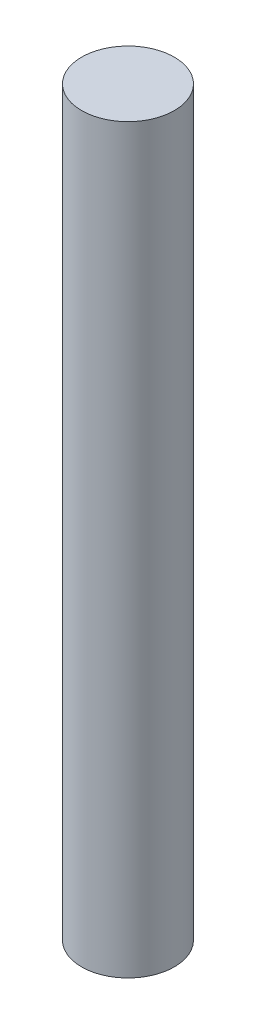
ISO-10303-21;
HEADER;
FILE_DESCRIPTION(('STEP AP214'),'2;1');
FILE_NAME('part.step','',(''),(''),'','','');
FILE_SCHEMA(('AUTOMOTIVE_DESIGN { 1 0 10303 214 1 1 1 1 }'));
ENDSEC;
DATA;
#1=APPLICATION_CONTEXT('core data for automotive mechanical design processes');
#2=APPLICATION_PROTOCOL_DEFINITION('international standard','automotive_design',2000,#1);
#3=PRODUCT_CONTEXT('',#1,'mechanical');
#4=PRODUCT('Part','Part','',(#3));
#5=PRODUCT_RELATED_PRODUCT_CATEGORY('part','',(#4));
#6=PRODUCT_DEFINITION_FORMATION('','',#4);
#7=PRODUCT_DEFINITION_CONTEXT('part definition',#1,'design');
#8=PRODUCT_DEFINITION('design','',#6,#7);
#9=PRODUCT_DEFINITION_SHAPE('','',#8);
#10=(LENGTH_UNIT() NAMED_UNIT(*) SI_UNIT(.MILLI.,.METRE.));
#11=(NAMED_UNIT(*) PLANE_ANGLE_UNIT() SI_UNIT($,.RADIAN.));
#12=(NAMED_UNIT(*) SI_UNIT($,.STERADIAN.) SOLID_ANGLE_UNIT());
#13=UNCERTAINTY_MEASURE_WITH_UNIT(LENGTH_MEASURE(1.E-05),#10,'distance_accuracy_value','');
#14=(GEOMETRIC_REPRESENTATION_CONTEXT(3) GLOBAL_UNCERTAINTY_ASSIGNED_CONTEXT((#13)) GLOBAL_UNIT_ASSIGNED_CONTEXT((#10,
#11,#12)) REPRESENTATION_CONTEXT('',''));
#15=CARTESIAN_POINT('',(0.,0.,0.));
#16=DIRECTION('',(0.,0.,1.));
#17=DIRECTION('',(1.,0.,0.));
#18=AXIS2_PLACEMENT_3D('',#15,#16,#17);
#19=CARTESIAN_POINT('',(0.,25.4,0.));
#20=DIRECTION('',(0.,-1.,0.));
#21=DIRECTION('',(0.,0.,-1.));
#22=AXIS2_PLACEMENT_3D('',#19,#20,#21);
#23=CYLINDRICAL_SURFACE('',#22,1.5875);
#24=CARTESIAN_POINT('',(0.,25.4,0.));
#25=DIRECTION('',(0.,1.,0.));
#26=DIRECTION('',(0.,0.,1.));
#27=AXIS2_PLACEMENT_3D('',#24,#25,#26);
#28=CIRCLE('',#27,1.5875);
#29=CARTESIAN_POINT('',(0.,25.4,1.5875));
#30=VERTEX_POINT('',#29);
#31=EDGE_CURVE('E10',#30,#30,#28,.T.);
#32=ORIENTED_EDGE('',*,*,#31,.F.);
#33=EDGE_LOOP('',(#32));
#34=FACE_BOUND('',#33,.T.);
#35=CARTESIAN_POINT('',(0.,0.,0.));
#36=DIRECTION('',(0.,1.,0.));
#37=DIRECTION('',(0.,0.,1.));
#38=AXIS2_PLACEMENT_3D('',#35,#36,#37);
#39=CIRCLE('',#38,1.5875);
#40=CARTESIAN_POINT('',(0.,0.,1.5875));
#41=VERTEX_POINT('',#40);
#42=EDGE_CURVE('E34',#41,#41,#39,.T.);
#43=ORIENTED_EDGE('',*,*,#42,.T.);
#44=EDGE_LOOP('',(#43));
#45=FACE_BOUND('',#44,.T.);
#46=ADVANCED_FACE('F31',(#34,#45),#23,.T.);
#47=CARTESIAN_POINT('',(0.,25.4,0.));
#48=DIRECTION('',(0.,1.,0.));
#49=DIRECTION('',(0.,0.,1.));
#50=AXIS2_PLACEMENT_3D('',#47,#48,#49);
#51=PLANE('',#50);
#52=ORIENTED_EDGE('',*,*,#31,.T.);
#53=EDGE_LOOP('',(#52));
#54=FACE_BOUND('',#53,.T.);
#55=ADVANCED_FACE('F46',(#54),#51,.T.);
#56=CARTESIAN_POINT('',(0.,0.,0.));
#57=DIRECTION('',(0.,1.,0.));
#58=DIRECTION('',(0.,0.,1.));
#59=AXIS2_PLACEMENT_3D('',#56,#57,#58);
#60=PLANE('',#59);
#61=ORIENTED_EDGE('',*,*,#42,.F.);
#62=EDGE_LOOP('',(#61));
#63=FACE_BOUND('',#62,.T.);
#64=ADVANCED_FACE('F44',(#63),#60,.F.);
#65=CLOSED_SHELL('',(#46,#55,#64));
#66=MANIFOLD_SOLID_BREP('B2',#65);
#67=ADVANCED_BREP_SHAPE_REPRESENTATION('',(#18,#66),#14);
#68=SHAPE_DEFINITION_REPRESENTATION(#9,#67);
ENDSEC;
END-ISO-10303-21;
